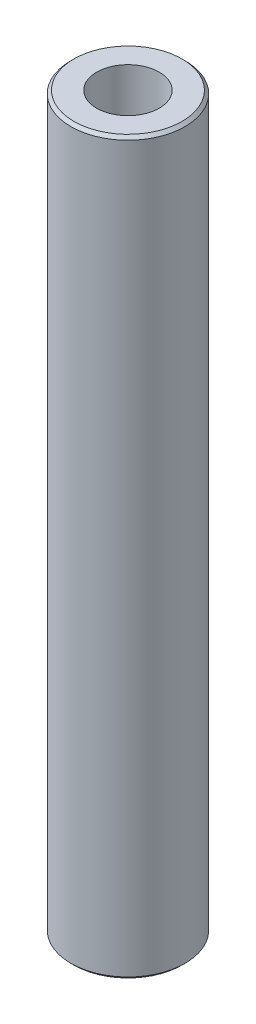
ISO-10303-21;
HEADER;
FILE_DESCRIPTION(('STEP AP214'),'2;1');
FILE_NAME('part.step','',(''),(''),'','','');
FILE_SCHEMA(('AUTOMOTIVE_DESIGN { 1 0 10303 214 1 1 1 1 }'));
ENDSEC;
DATA;
#1=APPLICATION_CONTEXT('core data for automotive mechanical design processes');
#2=APPLICATION_PROTOCOL_DEFINITION('international standard','automotive_design',2000,#1);
#3=PRODUCT_CONTEXT('',#1,'mechanical');
#4=PRODUCT('Part','Part','',(#3));
#5=PRODUCT_RELATED_PRODUCT_CATEGORY('part','',(#4));
#6=PRODUCT_DEFINITION_FORMATION('','',#4);
#7=PRODUCT_DEFINITION_CONTEXT('part definition',#1,'design');
#8=PRODUCT_DEFINITION('design','',#6,#7);
#9=PRODUCT_DEFINITION_SHAPE('','',#8);
#10=(LENGTH_UNIT() NAMED_UNIT(*) SI_UNIT(.MILLI.,.METRE.));
#11=(NAMED_UNIT(*) PLANE_ANGLE_UNIT() SI_UNIT($,.RADIAN.));
#12=(NAMED_UNIT(*) SI_UNIT($,.STERADIAN.) SOLID_ANGLE_UNIT());
#13=UNCERTAINTY_MEASURE_WITH_UNIT(LENGTH_MEASURE(1.E-05),#10,'distance_accuracy_value','');
#14=(GEOMETRIC_REPRESENTATION_CONTEXT(3) GLOBAL_UNCERTAINTY_ASSIGNED_CONTEXT((#13)) GLOBAL_UNIT_ASSIGNED_CONTEXT((#10,
#11,#12)) REPRESENTATION_CONTEXT('',''));
#15=CARTESIAN_POINT('',(0.,0.,0.));
#16=DIRECTION('',(0.,0.,1.));
#17=DIRECTION('',(1.,0.,0.));
#18=AXIS2_PLACEMENT_3D('',#15,#16,#17);
#19=CARTESIAN_POINT('',(0.,95.9495933540996,0.));
#20=DIRECTION('',(0.,-1.,0.));
#21=DIRECTION('',(0.,0.,-1.));
#22=AXIS2_PLACEMENT_3D('',#19,#20,#21);
#23=CYLINDRICAL_SURFACE('',#22,7.5);
#24=CARTESIAN_POINT('',(0.,95.5541669346828,0.));
#25=DIRECTION('',(0.,1.,0.));
#26=DIRECTION('',(0.,0.,1.));
#27=AXIS2_PLACEMENT_3D('',#24,#25,#26);
#28=CIRCLE('',#27,7.5);
#29=CARTESIAN_POINT('',(0.,95.5541669346828,7.5));
#30=VERTEX_POINT('',#29);
#31=EDGE_CURVE('E50',#30,#30,#28,.F.);
#32=ORIENTED_EDGE('',*,*,#31,.T.);
#33=EDGE_LOOP('',(#32));
#34=FACE_BOUND('',#33,.T.);
#35=CARTESIAN_POINT('',(0.,0.395426419416797,0.));
#36=DIRECTION('',(0.,1.,0.));
#37=DIRECTION('',(0.,0.,1.));
#38=AXIS2_PLACEMENT_3D('',#35,#36,#37);
#39=CIRCLE('',#38,7.5);
#40=CARTESIAN_POINT('',(0.,0.395426419416797,7.5));
#41=VERTEX_POINT('',#40);
#42=EDGE_CURVE('E51',#41,#41,#39,.T.);
#43=ORIENTED_EDGE('',*,*,#42,.T.);
#44=EDGE_LOOP('',(#43));
#45=FACE_BOUND('',#44,.T.);
#46=ADVANCED_FACE('F39',(#34,#45),#23,.T.);
#47=CARTESIAN_POINT('',(0.,95.9495933540996,0.));
#48=DIRECTION('',(0.,1.,0.));
#49=DIRECTION('',(0.,0.,1.));
#50=AXIS2_PLACEMENT_3D('',#47,#48,#49);
#51=PLANE('',#50);
#52=CARTESIAN_POINT('',(0.,95.9495933540996,0.));
#53=DIRECTION('',(0.,1.,0.));
#54=DIRECTION('',(0.,0.,1.));
#55=AXIS2_PLACEMENT_3D('',#52,#53,#54);
#56=CIRCLE('',#55,7.1045735805832);
#57=CARTESIAN_POINT('',(0.,95.9495933540996,7.1045735805832));
#58=VERTEX_POINT('',#57);
#59=EDGE_CURVE('E54',#58,#58,#56,.T.);
#60=ORIENTED_EDGE('',*,*,#59,.T.);
#61=EDGE_LOOP('',(#60));
#62=FACE_BOUND('',#61,.T.);
#63=CARTESIAN_POINT('',(0.,95.9495933540996,0.));
#64=DIRECTION('',(0.,1.,0.));
#65=DIRECTION('',(0.,0.,1.));
#66=AXIS2_PLACEMENT_3D('',#63,#64,#65);
#67=CIRCLE('',#66,4.10759110967434);
#68=CARTESIAN_POINT('',(0.,95.9495933540996,4.10759110967434));
#69=VERTEX_POINT('',#68);
#70=EDGE_CURVE('E58',#69,#69,#67,.T.);
#71=ORIENTED_EDGE('',*,*,#70,.F.);
#72=EDGE_LOOP('',(#71));
#73=FACE_BOUND('',#72,.T.);
#74=ADVANCED_FACE('F69',(#62,#73),#51,.T.);
#75=CARTESIAN_POINT('',(0.,0.,0.));
#76=DIRECTION('',(0.,1.,0.));
#77=DIRECTION('',(0.,0.,1.));
#78=AXIS2_PLACEMENT_3D('',#75,#76,#77);
#79=PLANE('',#78);
#80=CARTESIAN_POINT('',(0.,0.,0.));
#81=DIRECTION('',(0.,1.,0.));
#82=DIRECTION('',(0.,0.,1.));
#83=AXIS2_PLACEMENT_3D('',#80,#81,#82);
#84=CIRCLE('',#83,7.1045735805832);
#85=CARTESIAN_POINT('',(0.,0.,7.1045735805832));
#86=VERTEX_POINT('',#85);
#87=EDGE_CURVE('E10',#86,#86,#84,.F.);
#88=ORIENTED_EDGE('',*,*,#87,.T.);
#89=EDGE_LOOP('',(#88));
#90=FACE_BOUND('',#89,.T.);
#91=CARTESIAN_POINT('',(0.,0.,0.));
#92=DIRECTION('',(0.,1.,0.));
#93=DIRECTION('',(0.,0.,1.));
#94=AXIS2_PLACEMENT_3D('',#91,#92,#93);
#95=CIRCLE('',#94,4.10759110967434);
#96=CARTESIAN_POINT('',(0.,0.,4.10759110967434));
#97=VERTEX_POINT('',#96);
#98=EDGE_CURVE('E63',#97,#97,#95,.T.);
#99=ORIENTED_EDGE('',*,*,#98,.T.);
#100=EDGE_LOOP('',(#99));
#101=FACE_BOUND('',#100,.T.);
#102=ADVANCED_FACE('F75',(#90,#101),#79,.F.);
#103=CARTESIAN_POINT('',(0.,95.9495933540996,0.));
#104=DIRECTION('',(0.,-1.,0.));
#105=DIRECTION('',(0.,0.,-1.));
#106=AXIS2_PLACEMENT_3D('',#103,#104,#105);
#107=CYLINDRICAL_SURFACE('',#106,4.10759110967434);
#108=ORIENTED_EDGE('',*,*,#70,.T.);
#109=EDGE_LOOP('',(#108));
#110=FACE_BOUND('',#109,.T.);
#111=ORIENTED_EDGE('',*,*,#98,.F.);
#112=EDGE_LOOP('',(#111));
#113=FACE_BOUND('',#112,.T.);
#114=ADVANCED_FACE('F70',(#110,#113),#107,.F.);
#115=CARTESIAN_POINT('',(0.,95.9495933540996,0.));
#116=DIRECTION('',(0.,-1.,0.));
#117=DIRECTION('',(0.,0.,-1.));
#118=AXIS2_PLACEMENT_3D('',#115,#116,#117);
#119=CONICAL_SURFACE('',#118,7.1045735805832,0.78539816339744);
#120=ORIENTED_EDGE('',*,*,#31,.F.);
#121=EDGE_LOOP('',(#120));
#122=FACE_BOUND('',#121,.T.);
#123=ORIENTED_EDGE('',*,*,#59,.F.);
#124=EDGE_LOOP('',(#123));
#125=FACE_BOUND('',#124,.T.);
#126=ADVANCED_FACE('F81',(#122,#125),#119,.T.);
#127=CARTESIAN_POINT('',(0.,0.395426419416797,0.));
#128=DIRECTION('',(0.,1.,0.));
#129=DIRECTION('',(0.,0.,1.));
#130=AXIS2_PLACEMENT_3D('',#127,#128,#129);
#131=CONICAL_SURFACE('',#130,7.5,0.785398163397448);
#132=ORIENTED_EDGE('',*,*,#87,.F.);
#133=EDGE_LOOP('',(#132));
#134=FACE_BOUND('',#133,.T.);
#135=ORIENTED_EDGE('',*,*,#42,.F.);
#136=EDGE_LOOP('',(#135));
#137=FACE_BOUND('',#136,.T.);
#138=ADVANCED_FACE('F45',(#134,#137),#131,.T.);
#139=CLOSED_SHELL('',(#46,#74,#102,#114,#126,#138));
#140=MANIFOLD_SOLID_BREP('B2',#139);
#141=ADVANCED_BREP_SHAPE_REPRESENTATION('',(#18,#140),#14);
#142=SHAPE_DEFINITION_REPRESENTATION(#9,#141);
ENDSEC;
END-ISO-10303-21;
